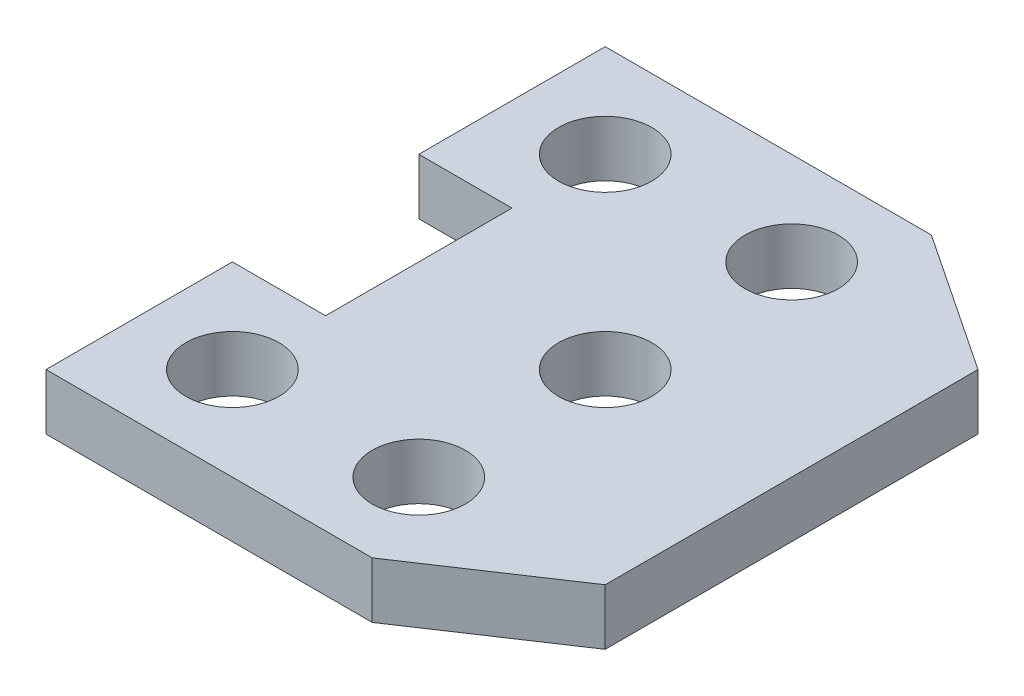
ISO-10303-21;
HEADER;
FILE_DESCRIPTION(('STEP AP214'),'2;1');
FILE_NAME('part.step','',(''),(''),'','','');
FILE_SCHEMA(('AUTOMOTIVE_DESIGN { 1 0 10303 214 1 1 1 1 }'));
ENDSEC;
DATA;
#1=APPLICATION_CONTEXT('core data for automotive mechanical design processes');
#2=APPLICATION_PROTOCOL_DEFINITION('international standard','automotive_design',2000,#1);
#3=PRODUCT_CONTEXT('',#1,'mechanical');
#4=PRODUCT('Part','Part','',(#3));
#5=PRODUCT_RELATED_PRODUCT_CATEGORY('part','',(#4));
#6=PRODUCT_DEFINITION_FORMATION('','',#4);
#7=PRODUCT_DEFINITION_CONTEXT('part definition',#1,'design');
#8=PRODUCT_DEFINITION('design','',#6,#7);
#9=PRODUCT_DEFINITION_SHAPE('','',#8);
#10=(LENGTH_UNIT() NAMED_UNIT(*) SI_UNIT(.MILLI.,.METRE.));
#11=(NAMED_UNIT(*) PLANE_ANGLE_UNIT() SI_UNIT($,.RADIAN.));
#12=(NAMED_UNIT(*) SI_UNIT($,.STERADIAN.) SOLID_ANGLE_UNIT());
#13=UNCERTAINTY_MEASURE_WITH_UNIT(LENGTH_MEASURE(1.E-05),#10,'distance_accuracy_value','');
#14=(GEOMETRIC_REPRESENTATION_CONTEXT(3) GLOBAL_UNCERTAINTY_ASSIGNED_CONTEXT((#13)) GLOBAL_UNIT_ASSIGNED_CONTEXT((#10,
#11,#12)) REPRESENTATION_CONTEXT('',''));
#15=CARTESIAN_POINT('',(0.,0.,0.));
#16=DIRECTION('',(0.,0.,1.));
#17=DIRECTION('',(1.,0.,0.));
#18=AXIS2_PLACEMENT_3D('',#15,#16,#17);
#19=CARTESIAN_POINT('',(0.,12.,0.));
#20=DIRECTION('',(0.,1.,0.));
#21=DIRECTION('',(0.,0.,1.));
#22=AXIS2_PLACEMENT_3D('',#19,#20,#21);
#23=PLANE('',#22);
#24=CARTESIAN_POINT('',(20.,12.,-20.));
#25=DIRECTION('',(0.,1.,0.));
#26=DIRECTION('',(0.,0.,1.));
#27=AXIS2_PLACEMENT_3D('',#24,#25,#26);
#28=CIRCLE('',#27,10.);
#29=CARTESIAN_POINT('',(20.,12.,-10.));
#30=VERTEX_POINT('',#29);
#31=EDGE_CURVE('E265',#30,#30,#28,.T.);
#32=ORIENTED_EDGE('',*,*,#31,.F.);
#33=EDGE_LOOP('',(#32));
#34=FACE_BOUND('',#33,.T.);
#35=CARTESIAN_POINT('',(60.,12.,-100.));
#36=DIRECTION('',(0.,1.,0.));
#37=DIRECTION('',(0.,0.,1.));
#38=AXIS2_PLACEMENT_3D('',#35,#36,#37);
#39=CIRCLE('',#38,9.99999999999999);
#40=CARTESIAN_POINT('',(60.,12.,-90.));
#41=VERTEX_POINT('',#40);
#42=EDGE_CURVE('E249',#41,#41,#39,.T.);
#43=ORIENTED_EDGE('',*,*,#42,.F.);
#44=EDGE_LOOP('',(#43));
#45=FACE_BOUND('',#44,.T.);
#46=DIRECTION('',(0.,0.,1.));
#47=VECTOR('',#46,1.);
#48=CARTESIAN_POINT('',(0.,12.,-40.));
#49=LINE('',#48,#47);
#50=CARTESIAN_POINT('',(0.,12.,-40.));
#51=VERTEX_POINT('',#50);
#52=CARTESIAN_POINT('',(0.,12.,0.));
#53=VERTEX_POINT('',#52);
#54=EDGE_CURVE('E182',#51,#53,#49,.T.);
#55=ORIENTED_EDGE('',*,*,#54,.T.);
#56=DIRECTION('',(1.,0.,0.));
#57=VECTOR('',#56,1.);
#58=CARTESIAN_POINT('',(0.,12.,0.));
#59=LINE('',#58,#57);
#60=CARTESIAN_POINT('',(70.,12.,0.));
#61=VERTEX_POINT('',#60);
#62=EDGE_CURVE('E106',#53,#61,#59,.T.);
#63=ORIENTED_EDGE('',*,*,#62,.T.);
#64=DIRECTION('',(0.832050294337844,0.,-0.554700196225229));
#65=VECTOR('',#64,1.);
#66=CARTESIAN_POINT('',(70.,12.,0.));
#67=LINE('',#66,#65);
#68=CARTESIAN_POINT('',(100.,12.,-20.));
#69=VERTEX_POINT('',#68);
#70=EDGE_CURVE('E211',#61,#69,#67,.T.);
#71=ORIENTED_EDGE('',*,*,#70,.T.);
#72=DIRECTION('',(0.,0.,-1.));
#73=VECTOR('',#72,1.);
#74=CARTESIAN_POINT('',(100.,12.,-20.));
#75=LINE('',#74,#73);
#76=CARTESIAN_POINT('',(100.,12.,-100.));
#77=VERTEX_POINT('',#76);
#78=EDGE_CURVE('E231',#69,#77,#75,.T.);
#79=ORIENTED_EDGE('',*,*,#78,.T.);
#80=DIRECTION('',(-0.832050294337843,0.,-0.554700196225229));
#81=VECTOR('',#80,1.);
#82=CARTESIAN_POINT('',(100.,12.,-100.));
#83=LINE('',#82,#81);
#84=CARTESIAN_POINT('',(70.,12.,-120.));
#85=VERTEX_POINT('',#84);
#86=EDGE_CURVE('E227',#77,#85,#83,.T.);
#87=ORIENTED_EDGE('',*,*,#86,.T.);
#88=DIRECTION('',(-1.,0.,0.));
#89=VECTOR('',#88,1.);
#90=CARTESIAN_POINT('',(70.,12.,-120.));
#91=LINE('',#90,#89);
#92=CARTESIAN_POINT('',(0.,12.,-120.));
#93=VERTEX_POINT('',#92);
#94=EDGE_CURVE('E230',#85,#93,#91,.T.);
#95=ORIENTED_EDGE('',*,*,#94,.T.);
#96=DIRECTION('',(0.,0.,1.));
#97=VECTOR('',#96,1.);
#98=CARTESIAN_POINT('',(0.,12.,-120.));
#99=LINE('',#98,#97);
#100=CARTESIAN_POINT('',(0.,12.,-80.));
#101=VERTEX_POINT('',#100);
#102=EDGE_CURVE('E131',#93,#101,#99,.T.);
#103=ORIENTED_EDGE('',*,*,#102,.T.);
#104=DIRECTION('',(1.,0.,0.));
#105=VECTOR('',#104,1.);
#106=CARTESIAN_POINT('',(0.,12.,-80.));
#107=LINE('',#106,#105);
#108=CARTESIAN_POINT('',(20.,12.,-80.));
#109=VERTEX_POINT('',#108);
#110=EDGE_CURVE('E125',#101,#109,#107,.T.);
#111=ORIENTED_EDGE('',*,*,#110,.T.);
#112=DIRECTION('',(0.,0.,1.));
#113=VECTOR('',#112,1.);
#114=CARTESIAN_POINT('',(20.,12.,-80.));
#115=LINE('',#114,#113);
#116=CARTESIAN_POINT('',(20.,12.,-40.));
#117=VERTEX_POINT('',#116);
#118=EDGE_CURVE('E129',#109,#117,#115,.T.);
#119=ORIENTED_EDGE('',*,*,#118,.T.);
#120=DIRECTION('',(-1.,0.,0.));
#121=VECTOR('',#120,1.);
#122=CARTESIAN_POINT('',(20.,12.,-40.));
#123=LINE('',#122,#121);
#124=EDGE_CURVE('E57',#117,#51,#123,.T.);
#125=ORIENTED_EDGE('',*,*,#124,.T.);
#126=EDGE_LOOP('',(#55,#63,#71,#79,#87,#95,#103,#111,#119,#125));
#127=FACE_BOUND('',#126,.T.);
#128=CARTESIAN_POINT('',(20.,12.,-100.));
#129=DIRECTION('',(0.,1.,0.));
#130=DIRECTION('',(0.,0.,1.));
#131=AXIS2_PLACEMENT_3D('',#128,#129,#130);
#132=CIRCLE('',#131,10.);
#133=CARTESIAN_POINT('',(20.,12.,-90.));
#134=VERTEX_POINT('',#133);
#135=EDGE_CURVE('E158',#134,#134,#132,.T.);
#136=ORIENTED_EDGE('',*,*,#135,.F.);
#137=EDGE_LOOP('',(#136));
#138=FACE_BOUND('',#137,.T.);
#139=CARTESIAN_POINT('',(60.,12.,-20.));
#140=DIRECTION('',(0.,1.,0.));
#141=DIRECTION('',(0.,0.,1.));
#142=AXIS2_PLACEMENT_3D('',#139,#140,#141);
#143=CIRCLE('',#142,10.);
#144=CARTESIAN_POINT('',(60.,12.,-9.99999999999999));
#145=VERTEX_POINT('',#144);
#146=EDGE_CURVE('E257',#145,#145,#143,.T.);
#147=ORIENTED_EDGE('',*,*,#146,.F.);
#148=EDGE_LOOP('',(#147));
#149=FACE_BOUND('',#148,.T.);
#150=CARTESIAN_POINT('',(60.,12.,-60.));
#151=DIRECTION('',(0.,1.,0.));
#152=DIRECTION('',(0.,0.,1.));
#153=AXIS2_PLACEMENT_3D('',#150,#151,#152);
#154=CIRCLE('',#153,10.);
#155=CARTESIAN_POINT('',(60.,12.,-50.));
#156=VERTEX_POINT('',#155);
#157=EDGE_CURVE('E273',#156,#156,#154,.T.);
#158=ORIENTED_EDGE('',*,*,#157,.F.);
#159=EDGE_LOOP('',(#158));
#160=FACE_BOUND('',#159,.T.);
#161=ADVANCED_FACE('F39',(#34,#45,#127,#138,#149,#160),#23,.T.);
#162=CARTESIAN_POINT('',(0.,0.,0.));
#163=DIRECTION('',(0.,1.,0.));
#164=DIRECTION('',(0.,0.,1.));
#165=AXIS2_PLACEMENT_3D('',#162,#163,#164);
#166=PLANE('',#165);
#167=DIRECTION('',(0.,0.,1.));
#168=VECTOR('',#167,1.);
#169=CARTESIAN_POINT('',(0.,0.,-40.));
#170=LINE('',#169,#168);
#171=CARTESIAN_POINT('',(0.,0.,-40.));
#172=VERTEX_POINT('',#171);
#173=CARTESIAN_POINT('',(0.,0.,0.));
#174=VERTEX_POINT('',#173);
#175=EDGE_CURVE('E153',#172,#174,#170,.T.);
#176=ORIENTED_EDGE('',*,*,#175,.F.);
#177=DIRECTION('',(-1.,0.,0.));
#178=VECTOR('',#177,1.);
#179=CARTESIAN_POINT('',(20.,0.,-40.));
#180=LINE('',#179,#178);
#181=CARTESIAN_POINT('',(20.,0.,-40.));
#182=VERTEX_POINT('',#181);
#183=EDGE_CURVE('E98',#182,#172,#180,.T.);
#184=ORIENTED_EDGE('',*,*,#183,.F.);
#185=DIRECTION('',(0.,0.,1.));
#186=VECTOR('',#185,1.);
#187=CARTESIAN_POINT('',(20.,0.,-80.));
#188=LINE('',#187,#186);
#189=CARTESIAN_POINT('',(20.,0.,-80.));
#190=VERTEX_POINT('',#189);
#191=EDGE_CURVE('E92',#190,#182,#188,.T.);
#192=ORIENTED_EDGE('',*,*,#191,.F.);
#193=DIRECTION('',(1.,0.,0.));
#194=VECTOR('',#193,1.);
#195=CARTESIAN_POINT('',(0.,0.,-80.));
#196=LINE('',#195,#194);
#197=CARTESIAN_POINT('',(0.,0.,-80.));
#198=VERTEX_POINT('',#197);
#199=EDGE_CURVE('E140',#198,#190,#196,.T.);
#200=ORIENTED_EDGE('',*,*,#199,.F.);
#201=DIRECTION('',(0.,0.,1.));
#202=VECTOR('',#201,1.);
#203=CARTESIAN_POINT('',(0.,0.,-120.));
#204=LINE('',#203,#202);
#205=CARTESIAN_POINT('',(0.,0.,-120.));
#206=VERTEX_POINT('',#205);
#207=EDGE_CURVE('E173',#206,#198,#204,.T.);
#208=ORIENTED_EDGE('',*,*,#207,.F.);
#209=DIRECTION('',(-1.,0.,0.));
#210=VECTOR('',#209,1.);
#211=CARTESIAN_POINT('',(70.,0.,-120.));
#212=LINE('',#211,#210);
#213=CARTESIAN_POINT('',(70.,0.,-120.));
#214=VERTEX_POINT('',#213);
#215=EDGE_CURVE('E170',#214,#206,#212,.T.);
#216=ORIENTED_EDGE('',*,*,#215,.F.);
#217=DIRECTION('',(-0.832050294337843,0.,-0.554700196225229));
#218=VECTOR('',#217,1.);
#219=CARTESIAN_POINT('',(100.,0.,-100.));
#220=LINE('',#219,#218);
#221=CARTESIAN_POINT('',(100.,0.,-100.));
#222=VERTEX_POINT('',#221);
#223=EDGE_CURVE('E167',#222,#214,#220,.T.);
#224=ORIENTED_EDGE('',*,*,#223,.F.);
#225=DIRECTION('',(0.,0.,-1.));
#226=VECTOR('',#225,1.);
#227=CARTESIAN_POINT('',(100.,0.,-20.));
#228=LINE('',#227,#226);
#229=CARTESIAN_POINT('',(100.,0.,-20.));
#230=VERTEX_POINT('',#229);
#231=EDGE_CURVE('E164',#230,#222,#228,.T.);
#232=ORIENTED_EDGE('',*,*,#231,.F.);
#233=DIRECTION('',(0.832050294337844,0.,-0.554700196225229));
#234=VECTOR('',#233,1.);
#235=CARTESIAN_POINT('',(70.,0.,0.));
#236=LINE('',#235,#234);
#237=CARTESIAN_POINT('',(70.,0.,0.));
#238=VERTEX_POINT('',#237);
#239=EDGE_CURVE('E161',#238,#230,#236,.T.);
#240=ORIENTED_EDGE('',*,*,#239,.F.);
#241=DIRECTION('',(1.,0.,0.));
#242=VECTOR('',#241,1.);
#243=CARTESIAN_POINT('',(0.,0.,0.));
#244=LINE('',#243,#242);
#245=EDGE_CURVE('E157',#174,#238,#244,.T.);
#246=ORIENTED_EDGE('',*,*,#245,.F.);
#247=EDGE_LOOP('',(#176,#184,#192,#200,#208,#216,#224,#232,#240,#246));
#248=FACE_BOUND('',#247,.T.);
#249=CARTESIAN_POINT('',(20.,0.,-100.));
#250=DIRECTION('',(0.,1.,0.));
#251=DIRECTION('',(0.,0.,1.));
#252=AXIS2_PLACEMENT_3D('',#249,#250,#251);
#253=CIRCLE('',#252,10.);
#254=CARTESIAN_POINT('',(20.,0.,-90.));
#255=VERTEX_POINT('',#254);
#256=EDGE_CURVE('E245',#255,#255,#253,.T.);
#257=ORIENTED_EDGE('',*,*,#256,.T.);
#258=EDGE_LOOP('',(#257));
#259=FACE_BOUND('',#258,.T.);
#260=CARTESIAN_POINT('',(60.,0.,-100.));
#261=DIRECTION('',(0.,1.,0.));
#262=DIRECTION('',(0.,0.,1.));
#263=AXIS2_PLACEMENT_3D('',#260,#261,#262);
#264=CIRCLE('',#263,9.99999999999999);
#265=CARTESIAN_POINT('',(60.,0.,-90.));
#266=VERTEX_POINT('',#265);
#267=EDGE_CURVE('E253',#266,#266,#264,.T.);
#268=ORIENTED_EDGE('',*,*,#267,.T.);
#269=EDGE_LOOP('',(#268));
#270=FACE_BOUND('',#269,.T.);
#271=CARTESIAN_POINT('',(60.,0.,-20.));
#272=DIRECTION('',(0.,1.,0.));
#273=DIRECTION('',(0.,0.,1.));
#274=AXIS2_PLACEMENT_3D('',#271,#272,#273);
#275=CIRCLE('',#274,10.);
#276=CARTESIAN_POINT('',(60.,0.,-9.99999999999999));
#277=VERTEX_POINT('',#276);
#278=EDGE_CURVE('E261',#277,#277,#275,.T.);
#279=ORIENTED_EDGE('',*,*,#278,.T.);
#280=EDGE_LOOP('',(#279));
#281=FACE_BOUND('',#280,.T.);
#282=CARTESIAN_POINT('',(20.,0.,-20.));
#283=DIRECTION('',(0.,1.,0.));
#284=DIRECTION('',(0.,0.,1.));
#285=AXIS2_PLACEMENT_3D('',#282,#283,#284);
#286=CIRCLE('',#285,10.);
#287=CARTESIAN_POINT('',(20.,0.,-10.));
#288=VERTEX_POINT('',#287);
#289=EDGE_CURVE('E269',#288,#288,#286,.T.);
#290=ORIENTED_EDGE('',*,*,#289,.T.);
#291=EDGE_LOOP('',(#290));
#292=FACE_BOUND('',#291,.T.);
#293=CARTESIAN_POINT('',(60.,0.,-60.));
#294=DIRECTION('',(0.,1.,0.));
#295=DIRECTION('',(0.,0.,1.));
#296=AXIS2_PLACEMENT_3D('',#293,#294,#295);
#297=CIRCLE('',#296,10.);
#298=CARTESIAN_POINT('',(60.,0.,-50.));
#299=VERTEX_POINT('',#298);
#300=EDGE_CURVE('E277',#299,#299,#297,.T.);
#301=ORIENTED_EDGE('',*,*,#300,.T.);
#302=EDGE_LOOP('',(#301));
#303=FACE_BOUND('',#302,.T.);
#304=ADVANCED_FACE('F215',(#248,#259,#270,#281,#292,#303),#166,.F.);
#305=CARTESIAN_POINT('',(0.,12.,-40.));
#306=DIRECTION('',(1.,0.,0.));
#307=DIRECTION('',(0.,0.,-1.));
#308=AXIS2_PLACEMENT_3D('',#305,#306,#307);
#309=PLANE('',#308);
#310=ORIENTED_EDGE('',*,*,#175,.T.);
#311=DIRECTION('',(0.,-1.,0.));
#312=VECTOR('',#311,1.);
#313=CARTESIAN_POINT('',(0.,12.,0.));
#314=LINE('',#313,#312);
#315=EDGE_CURVE('E11',#53,#174,#314,.T.);
#316=ORIENTED_EDGE('',*,*,#315,.F.);
#317=ORIENTED_EDGE('',*,*,#54,.F.);
#318=DIRECTION('',(0.,-1.,0.));
#319=VECTOR('',#318,1.);
#320=CARTESIAN_POINT('',(0.,12.,-40.));
#321=LINE('',#320,#319);
#322=EDGE_CURVE('E149',#51,#172,#321,.T.);
#323=ORIENTED_EDGE('',*,*,#322,.T.);
#324=EDGE_LOOP('',(#310,#316,#317,#323));
#325=FACE_BOUND('',#324,.T.);
#326=ADVANCED_FACE('F41',(#325),#309,.F.);
#327=CARTESIAN_POINT('',(0.,12.,0.));
#328=DIRECTION('',(0.,0.,-1.));
#329=DIRECTION('',(-1.,0.,0.));
#330=AXIS2_PLACEMENT_3D('',#327,#328,#329);
#331=PLANE('',#330);
#332=ORIENTED_EDGE('',*,*,#245,.T.);
#333=DIRECTION('',(0.,-1.,0.));
#334=VECTOR('',#333,1.);
#335=CARTESIAN_POINT('',(70.,12.,0.));
#336=LINE('',#335,#334);
#337=EDGE_CURVE('E49',#61,#238,#336,.T.);
#338=ORIENTED_EDGE('',*,*,#337,.F.);
#339=ORIENTED_EDGE('',*,*,#62,.F.);
#340=ORIENTED_EDGE('',*,*,#315,.T.);
#341=EDGE_LOOP('',(#332,#338,#339,#340));
#342=FACE_BOUND('',#341,.T.);
#343=ADVANCED_FACE('F321',(#342),#331,.F.);
#344=CARTESIAN_POINT('',(70.,12.,0.));
#345=DIRECTION('',(-0.554700196225229,0.,-0.832050294337843));
#346=DIRECTION('',(-0.832050294337844,0.,0.554700196225229));
#347=AXIS2_PLACEMENT_3D('',#344,#345,#346);
#348=PLANE('',#347);
#349=ORIENTED_EDGE('',*,*,#239,.T.);
#350=DIRECTION('',(0.,-1.,0.));
#351=VECTOR('',#350,1.);
#352=CARTESIAN_POINT('',(100.,12.,-20.));
#353=LINE('',#352,#351);
#354=EDGE_CURVE('E201',#69,#230,#353,.T.);
#355=ORIENTED_EDGE('',*,*,#354,.F.);
#356=ORIENTED_EDGE('',*,*,#70,.F.);
#357=ORIENTED_EDGE('',*,*,#337,.T.);
#358=EDGE_LOOP('',(#349,#355,#356,#357));
#359=FACE_BOUND('',#358,.T.);
#360=ADVANCED_FACE('F209',(#359),#348,.F.);
#361=CARTESIAN_POINT('',(100.,12.,-20.));
#362=DIRECTION('',(-1.,0.,0.));
#363=DIRECTION('',(0.,0.,1.));
#364=AXIS2_PLACEMENT_3D('',#361,#362,#363);
#365=PLANE('',#364);
#366=ORIENTED_EDGE('',*,*,#231,.T.);
#367=DIRECTION('',(0.,-1.,0.));
#368=VECTOR('',#367,1.);
#369=CARTESIAN_POINT('',(100.,12.,-100.));
#370=LINE('',#369,#368);
#371=EDGE_CURVE('E197',#77,#222,#370,.T.);
#372=ORIENTED_EDGE('',*,*,#371,.F.);
#373=ORIENTED_EDGE('',*,*,#78,.F.);
#374=ORIENTED_EDGE('',*,*,#354,.T.);
#375=EDGE_LOOP('',(#366,#372,#373,#374));
#376=FACE_BOUND('',#375,.T.);
#377=ADVANCED_FACE('F221',(#376),#365,.F.);
#378=CARTESIAN_POINT('',(100.,12.,-100.));
#379=DIRECTION('',(-0.554700196225229,0.,0.832050294337843));
#380=DIRECTION('',(0.832050294337844,0.,0.554700196225229));
#381=AXIS2_PLACEMENT_3D('',#378,#379,#380);
#382=PLANE('',#381);
#383=ORIENTED_EDGE('',*,*,#223,.T.);
#384=DIRECTION('',(0.,-1.,0.));
#385=VECTOR('',#384,1.);
#386=CARTESIAN_POINT('',(70.,12.,-120.));
#387=LINE('',#386,#385);
#388=EDGE_CURVE('E193',#85,#214,#387,.T.);
#389=ORIENTED_EDGE('',*,*,#388,.F.);
#390=ORIENTED_EDGE('',*,*,#86,.F.);
#391=ORIENTED_EDGE('',*,*,#371,.T.);
#392=EDGE_LOOP('',(#383,#389,#390,#391));
#393=FACE_BOUND('',#392,.T.);
#394=ADVANCED_FACE('F225',(#393),#382,.F.);
#395=CARTESIAN_POINT('',(70.,12.,-120.));
#396=DIRECTION('',(0.,0.,1.));
#397=DIRECTION('',(1.,0.,0.));
#398=AXIS2_PLACEMENT_3D('',#395,#396,#397);
#399=PLANE('',#398);
#400=ORIENTED_EDGE('',*,*,#215,.T.);
#401=DIRECTION('',(0.,-1.,0.));
#402=VECTOR('',#401,1.);
#403=CARTESIAN_POINT('',(0.,12.,-120.));
#404=LINE('',#403,#402);
#405=EDGE_CURVE('E189',#93,#206,#404,.T.);
#406=ORIENTED_EDGE('',*,*,#405,.F.);
#407=ORIENTED_EDGE('',*,*,#94,.F.);
#408=ORIENTED_EDGE('',*,*,#388,.T.);
#409=EDGE_LOOP('',(#400,#406,#407,#408));
#410=FACE_BOUND('',#409,.T.);
#411=ADVANCED_FACE('F311',(#410),#399,.F.);
#412=CARTESIAN_POINT('',(0.,12.,-120.));
#413=DIRECTION('',(1.,0.,0.));
#414=DIRECTION('',(0.,0.,-1.));
#415=AXIS2_PLACEMENT_3D('',#412,#413,#414);
#416=PLANE('',#415);
#417=ORIENTED_EDGE('',*,*,#207,.T.);
#418=DIRECTION('',(0.,-1.,0.));
#419=VECTOR('',#418,1.);
#420=CARTESIAN_POINT('',(0.,12.,-80.));
#421=LINE('',#420,#419);
#422=EDGE_CURVE('E142',#101,#198,#421,.T.);
#423=ORIENTED_EDGE('',*,*,#422,.F.);
#424=ORIENTED_EDGE('',*,*,#102,.F.);
#425=ORIENTED_EDGE('',*,*,#405,.T.);
#426=EDGE_LOOP('',(#417,#423,#424,#425));
#427=FACE_BOUND('',#426,.T.);
#428=ADVANCED_FACE('F308',(#427),#416,.F.);
#429=CARTESIAN_POINT('',(0.,12.,-80.));
#430=DIRECTION('',(0.,0.,-1.));
#431=DIRECTION('',(-1.,0.,0.));
#432=AXIS2_PLACEMENT_3D('',#429,#430,#431);
#433=PLANE('',#432);
#434=ORIENTED_EDGE('',*,*,#199,.T.);
#435=DIRECTION('',(0.,-1.,0.));
#436=VECTOR('',#435,1.);
#437=CARTESIAN_POINT('',(20.,12.,-80.));
#438=LINE('',#437,#436);
#439=EDGE_CURVE('E137',#109,#190,#438,.T.);
#440=ORIENTED_EDGE('',*,*,#439,.F.);
#441=ORIENTED_EDGE('',*,*,#110,.F.);
#442=ORIENTED_EDGE('',*,*,#422,.T.);
#443=EDGE_LOOP('',(#434,#440,#441,#442));
#444=FACE_BOUND('',#443,.T.);
#445=ADVANCED_FACE('F138',(#444),#433,.F.);
#446=CARTESIAN_POINT('',(20.,12.,-80.));
#447=DIRECTION('',(1.,0.,0.));
#448=DIRECTION('',(0.,0.,-1.));
#449=AXIS2_PLACEMENT_3D('',#446,#447,#448);
#450=PLANE('',#449);
#451=ORIENTED_EDGE('',*,*,#191,.T.);
#452=DIRECTION('',(0.,-1.,0.));
#453=VECTOR('',#452,1.);
#454=CARTESIAN_POINT('',(20.,12.,-40.));
#455=LINE('',#454,#453);
#456=EDGE_CURVE('E143',#117,#182,#455,.T.);
#457=ORIENTED_EDGE('',*,*,#456,.F.);
#458=ORIENTED_EDGE('',*,*,#118,.F.);
#459=ORIENTED_EDGE('',*,*,#439,.T.);
#460=EDGE_LOOP('',(#451,#457,#458,#459));
#461=FACE_BOUND('',#460,.T.);
#462=ADVANCED_FACE('F145',(#461),#450,.F.);
#463=CARTESIAN_POINT('',(20.,12.,-40.));
#464=DIRECTION('',(0.,0.,1.));
#465=DIRECTION('',(1.,0.,0.));
#466=AXIS2_PLACEMENT_3D('',#463,#464,#465);
#467=PLANE('',#466);
#468=ORIENTED_EDGE('',*,*,#183,.T.);
#469=ORIENTED_EDGE('',*,*,#322,.F.);
#470=ORIENTED_EDGE('',*,*,#124,.F.);
#471=ORIENTED_EDGE('',*,*,#456,.T.);
#472=EDGE_LOOP('',(#468,#469,#470,#471));
#473=FACE_BOUND('',#472,.T.);
#474=ADVANCED_FACE('F301',(#473),#467,.F.);
#475=CARTESIAN_POINT('',(20.,12.,-100.));
#476=DIRECTION('',(0.,-1.,0.));
#477=DIRECTION('',(0.,0.,-1.));
#478=AXIS2_PLACEMENT_3D('',#475,#476,#477);
#479=CYLINDRICAL_SURFACE('',#478,10.);
#480=ORIENTED_EDGE('',*,*,#135,.T.);
#481=EDGE_LOOP('',(#480));
#482=FACE_BOUND('',#481,.T.);
#483=ORIENTED_EDGE('',*,*,#256,.F.);
#484=EDGE_LOOP('',(#483));
#485=FACE_BOUND('',#484,.T.);
#486=ADVANCED_FACE('F298',(#482,#485),#479,.F.);
#487=CARTESIAN_POINT('',(60.,12.,-100.));
#488=DIRECTION('',(0.,-1.,0.));
#489=DIRECTION('',(0.,0.,-1.));
#490=AXIS2_PLACEMENT_3D('',#487,#488,#489);
#491=CYLINDRICAL_SURFACE('',#490,9.99999999999999);
#492=ORIENTED_EDGE('',*,*,#42,.T.);
#493=EDGE_LOOP('',(#492));
#494=FACE_BOUND('',#493,.T.);
#495=ORIENTED_EDGE('',*,*,#267,.F.);
#496=EDGE_LOOP('',(#495));
#497=FACE_BOUND('',#496,.T.);
#498=ADVANCED_FACE('F397',(#494,#497),#491,.F.);
#499=CARTESIAN_POINT('',(60.,12.,-20.));
#500=DIRECTION('',(0.,-1.,0.));
#501=DIRECTION('',(0.,0.,-1.));
#502=AXIS2_PLACEMENT_3D('',#499,#500,#501);
#503=CYLINDRICAL_SURFACE('',#502,10.);
#504=ORIENTED_EDGE('',*,*,#146,.T.);
#505=EDGE_LOOP('',(#504));
#506=FACE_BOUND('',#505,.T.);
#507=ORIENTED_EDGE('',*,*,#278,.F.);
#508=EDGE_LOOP('',(#507));
#509=FACE_BOUND('',#508,.T.);
#510=ADVANCED_FACE('F405',(#506,#509),#503,.F.);
#511=CARTESIAN_POINT('',(20.,12.,-20.));
#512=DIRECTION('',(0.,-1.,0.));
#513=DIRECTION('',(0.,0.,-1.));
#514=AXIS2_PLACEMENT_3D('',#511,#512,#513);
#515=CYLINDRICAL_SURFACE('',#514,10.);
#516=ORIENTED_EDGE('',*,*,#31,.T.);
#517=EDGE_LOOP('',(#516));
#518=FACE_BOUND('',#517,.T.);
#519=ORIENTED_EDGE('',*,*,#289,.F.);
#520=EDGE_LOOP('',(#519));
#521=FACE_BOUND('',#520,.T.);
#522=ADVANCED_FACE('F413',(#518,#521),#515,.F.);
#523=CARTESIAN_POINT('',(60.,12.,-60.));
#524=DIRECTION('',(0.,-1.,0.));
#525=DIRECTION('',(0.,0.,-1.));
#526=AXIS2_PLACEMENT_3D('',#523,#524,#525);
#527=CYLINDRICAL_SURFACE('',#526,10.);
#528=ORIENTED_EDGE('',*,*,#157,.T.);
#529=EDGE_LOOP('',(#528));
#530=FACE_BOUND('',#529,.T.);
#531=ORIENTED_EDGE('',*,*,#300,.F.);
#532=EDGE_LOOP('',(#531));
#533=FACE_BOUND('',#532,.T.);
#534=ADVANCED_FACE('F285',(#530,#533),#527,.F.);
#535=CLOSED_SHELL('',(#161,#304,#326,#343,#360,#377,#394,#411,#428,#445,#462,#474,#486,#498,
#510,#522,#534));
#536=MANIFOLD_SOLID_BREP('B2',#535);
#537=ADVANCED_BREP_SHAPE_REPRESENTATION('',(#18,#536),#14);
#538=SHAPE_DEFINITION_REPRESENTATION(#9,#537);
ENDSEC;
END-ISO-10303-21;
